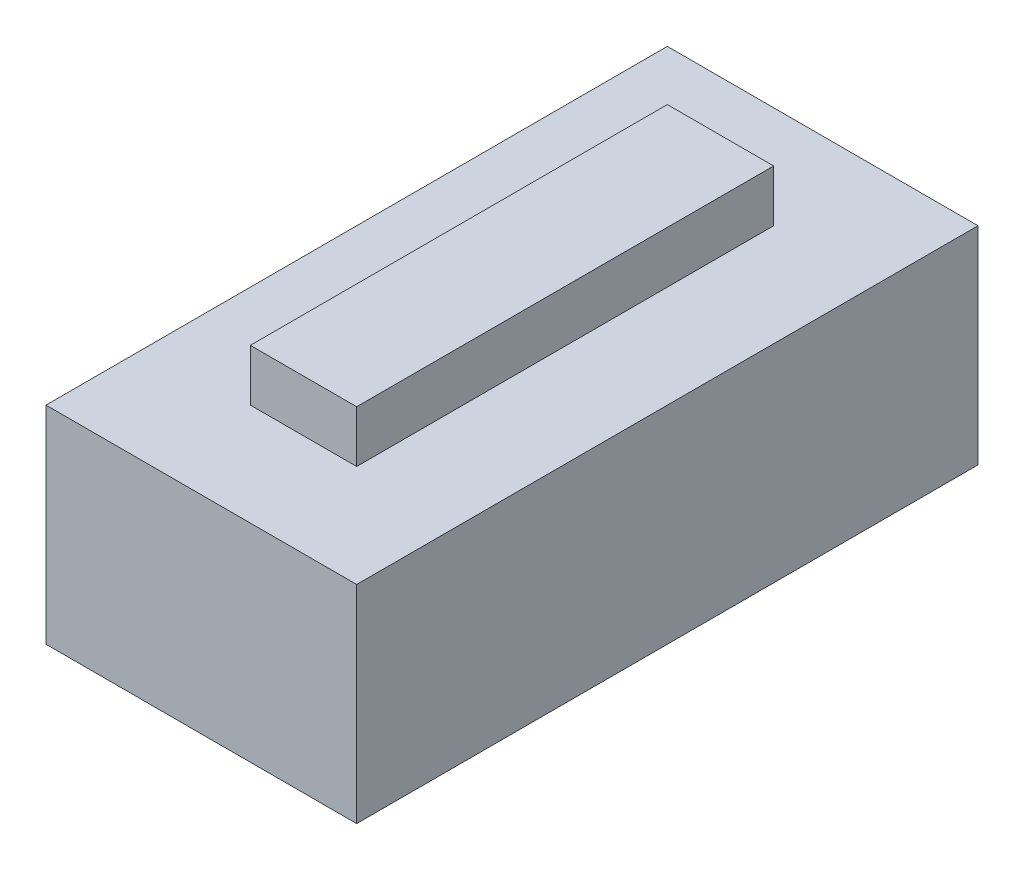
ISO-10303-21;
HEADER;
FILE_DESCRIPTION(('STEP AP214'),'2;1');
FILE_NAME('part.step','',(''),(''),'','','');
FILE_SCHEMA(('AUTOMOTIVE_DESIGN { 1 0 10303 214 1 1 1 1 }'));
ENDSEC;
DATA;
#1=APPLICATION_CONTEXT('core data for automotive mechanical design processes');
#2=APPLICATION_PROTOCOL_DEFINITION('international standard','automotive_design',2000,#1);
#3=PRODUCT_CONTEXT('',#1,'mechanical');
#4=PRODUCT('Part','Part','',(#3));
#5=PRODUCT_RELATED_PRODUCT_CATEGORY('part','',(#4));
#6=PRODUCT_DEFINITION_FORMATION('','',#4);
#7=PRODUCT_DEFINITION_CONTEXT('part definition',#1,'design');
#8=PRODUCT_DEFINITION('design','',#6,#7);
#9=PRODUCT_DEFINITION_SHAPE('','',#8);
#10=(LENGTH_UNIT() NAMED_UNIT(*) SI_UNIT(.MILLI.,.METRE.));
#11=(NAMED_UNIT(*) PLANE_ANGLE_UNIT() SI_UNIT($,.RADIAN.));
#12=(NAMED_UNIT(*) SI_UNIT($,.STERADIAN.) SOLID_ANGLE_UNIT());
#13=UNCERTAINTY_MEASURE_WITH_UNIT(LENGTH_MEASURE(1.E-05),#10,'distance_accuracy_value','');
#14=(GEOMETRIC_REPRESENTATION_CONTEXT(3) GLOBAL_UNCERTAINTY_ASSIGNED_CONTEXT((#13)) GLOBAL_UNIT_ASSIGNED_CONTEXT((#10,
#11,#12)) REPRESENTATION_CONTEXT('',''));
#15=CARTESIAN_POINT('',(0.,0.,0.));
#16=DIRECTION('',(0.,0.,1.));
#17=DIRECTION('',(1.,0.,0.));
#18=AXIS2_PLACEMENT_3D('',#15,#16,#17);
#19=CARTESIAN_POINT('',(-4.43132054060698,5.50000004055861,-39.1298540681601));
#20=DIRECTION('',(0.,0.,-1.));
#21=DIRECTION('',(0.,-1.,0.));
#22=AXIS2_PLACEMENT_3D('',#19,#20,#21);
#23=PLANE('',#22);
#24=DIRECTION('',(1.,0.,0.));
#25=VECTOR('',#24,1.);
#26=CARTESIAN_POINT('',(3.27780229315332,3.50000004055861,-39.1298540681601));
#27=LINE('',#26,#25);
#28=CARTESIAN_POINT('',(-4.43132054060698,3.50000004055861,-39.1298540681601));
#29=VERTEX_POINT('',#28);
#30=CARTESIAN_POINT('',(-1.43132049590349,3.50000004055861,-39.1298540681601));
#31=VERTEX_POINT('',#30);
#32=EDGE_CURVE('E133',#29,#31,#27,.T.);
#33=ORIENTED_EDGE('',*,*,#32,.T.);
#34=DIRECTION('',(0.,-1.,0.));
#35=VECTOR('',#34,1.);
#36=CARTESIAN_POINT('',(-1.43132049590349,5.50000004055861,-39.1298540681601));
#37=LINE('',#36,#35);
#38=CARTESIAN_POINT('',(-1.43132049590349,1.49999995944139,-39.1298540681601));
#39=VERTEX_POINT('',#38);
#40=EDGE_CURVE('E11',#31,#39,#37,.T.);
#41=ORIENTED_EDGE('',*,*,#40,.T.);
#42=DIRECTION('',(1.,0.,0.));
#43=VECTOR('',#42,1.);
#44=CARTESIAN_POINT('',(-2.21566027030349,1.5,-39.1298540681601));
#45=LINE('',#44,#43);
#46=CARTESIAN_POINT('',(-4.43132054060698,1.49999995944139,-39.1298540681601));
#47=VERTEX_POINT('',#46);
#48=EDGE_CURVE('E166',#47,#39,#45,.T.);
#49=ORIENTED_EDGE('',*,*,#48,.F.);
#50=DIRECTION('',(0.,-1.,0.));
#51=VECTOR('',#50,1.);
#52=CARTESIAN_POINT('',(-4.43132054060698,5.50000004055861,-39.1298540681601));
#53=LINE('',#52,#51);
#54=EDGE_CURVE('E27',#29,#47,#53,.T.);
#55=ORIENTED_EDGE('',*,*,#54,.F.);
#56=EDGE_LOOP('',(#33,#41,#49,#55));
#57=FACE_BOUND('',#56,.T.);
#58=ADVANCED_FACE('F16',(#57),#23,.T.);
#59=CARTESIAN_POINT('',(-1.43132049590349,5.50000004055861,-39.1298540681601));
#60=DIRECTION('',(1.,0.,0.));
#61=DIRECTION('',(0.,1.,0.));
#62=AXIS2_PLACEMENT_3D('',#59,#60,#61);
#63=PLANE('',#62);
#64=DIRECTION('',(0.,0.,1.));
#65=VECTOR('',#64,1.);
#66=CARTESIAN_POINT('',(-1.43132049590349,3.50000004055861,-23.2105978149711));
#67=LINE('',#66,#65);
#68=CARTESIAN_POINT('',(-1.43132049590349,3.50000004055861,-33.1298539787531));
#69=VERTEX_POINT('',#68);
#70=EDGE_CURVE('E182',#31,#69,#67,.T.);
#71=ORIENTED_EDGE('',*,*,#70,.T.);
#72=DIRECTION('',(0.,-1.,0.));
#73=VECTOR('',#72,1.);
#74=CARTESIAN_POINT('',(-1.43132049590349,5.50000004055861,-33.1298539787531));
#75=LINE('',#74,#73);
#76=CARTESIAN_POINT('',(-1.43132049590349,1.49999995944139,-33.1298539787531));
#77=VERTEX_POINT('',#76);
#78=EDGE_CURVE('E146',#69,#77,#75,.T.);
#79=ORIENTED_EDGE('',*,*,#78,.T.);
#80=DIRECTION('',(0.,0.,1.));
#81=VECTOR('',#80,1.);
#82=CARTESIAN_POINT('',(-1.43132049590349,1.5,-19.56492703408));
#83=LINE('',#82,#81);
#84=EDGE_CURVE('E164',#39,#77,#83,.T.);
#85=ORIENTED_EDGE('',*,*,#84,.F.);
#86=ORIENTED_EDGE('',*,*,#40,.F.);
#87=EDGE_LOOP('',(#71,#79,#85,#86));
#88=FACE_BOUND('',#87,.T.);
#89=ADVANCED_FACE('F210',(#88),#63,.T.);
#90=CARTESIAN_POINT('',(-4.43132054060698,5.50000004055861,-33.1298539787531));
#91=DIRECTION('',(-1.,0.,0.));
#92=DIRECTION('',(0.,0.,1.));
#93=AXIS2_PLACEMENT_3D('',#90,#91,#92);
#94=PLANE('',#93);
#95=DIRECTION('',(0.,0.,-1.));
#96=VECTOR('',#95,1.);
#97=CARTESIAN_POINT('',(-4.43132054060697,3.50000004055861,-20.2105977702676));
#98=LINE('',#97,#96);
#99=CARTESIAN_POINT('',(-4.43132054060698,3.50000004055861,-33.1298539787531));
#100=VERTEX_POINT('',#99);
#101=EDGE_CURVE('E138',#100,#29,#98,.T.);
#102=ORIENTED_EDGE('',*,*,#101,.T.);
#103=ORIENTED_EDGE('',*,*,#54,.T.);
#104=DIRECTION('',(0.,0.,-1.));
#105=VECTOR('',#104,1.);
#106=CARTESIAN_POINT('',(-4.43132054060698,1.5,-16.5649269893765));
#107=LINE('',#106,#105);
#108=CARTESIAN_POINT('',(-4.43132054060698,1.49999995944139,-33.1298539787531));
#109=VERTEX_POINT('',#108);
#110=EDGE_CURVE('E151',#109,#47,#107,.T.);
#111=ORIENTED_EDGE('',*,*,#110,.F.);
#112=DIRECTION('',(0.,-1.,0.));
#113=VECTOR('',#112,1.);
#114=CARTESIAN_POINT('',(-4.43132054060698,5.50000004055861,-33.1298539787531));
#115=LINE('',#114,#113);
#116=EDGE_CURVE('E143',#100,#109,#115,.T.);
#117=ORIENTED_EDGE('',*,*,#116,.F.);
#118=EDGE_LOOP('',(#102,#103,#111,#117));
#119=FACE_BOUND('',#118,.T.);
#120=ADVANCED_FACE('F212',(#119),#94,.T.);
#121=CARTESIAN_POINT('',(-1.43132049590349,5.50000004055861,-33.1298539787531));
#122=DIRECTION('',(0.,0.,1.));
#123=DIRECTION('',(1.,0.,0.));
#124=AXIS2_PLACEMENT_3D('',#121,#122,#123);
#125=PLANE('',#124);
#126=DIRECTION('',(-1.,0.,0.));
#127=VECTOR('',#126,1.);
#128=CARTESIAN_POINT('',(4.77780231550506,3.50000004055861,-33.1298539787531));
#129=LINE('',#128,#127);
#130=EDGE_CURVE('E142',#69,#100,#129,.T.);
#131=ORIENTED_EDGE('',*,*,#130,.T.);
#132=ORIENTED_EDGE('',*,*,#116,.T.);
#133=DIRECTION('',(-1.,0.,0.));
#134=VECTOR('',#133,1.);
#135=CARTESIAN_POINT('',(-0.715660247951746,1.5,-33.1298539787531));
#136=LINE('',#135,#134);
#137=EDGE_CURVE('E147',#77,#109,#136,.T.);
#138=ORIENTED_EDGE('',*,*,#137,.F.);
#139=ORIENTED_EDGE('',*,*,#78,.F.);
#140=EDGE_LOOP('',(#131,#132,#138,#139));
#141=FACE_BOUND('',#140,.T.);
#142=ADVANCED_FACE('F18',(#141),#125,.T.);
#143=CARTESIAN_POINT('',(10.9869251269136,3.50000004055861,-7.29134156178215));
#144=DIRECTION('',(0.,-1.,0.));
#145=DIRECTION('',(0.,0.,-1.));
#146=AXIS2_PLACEMENT_3D('',#143,#144,#145);
#147=PLANE('',#146);
#148=DIRECTION('',(1.,0.,0.));
#149=VECTOR('',#148,1.);
#150=CARTESIAN_POINT('',(3.77108865187963,3.50000004055861,-38.1432813507074));
#151=LINE('',#150,#149);
#152=CARTESIAN_POINT('',(-3.44474782315435,3.5,-38.1432813507074));
#153=VERTEX_POINT('',#152);
#154=CARTESIAN_POINT('',(-2.41789321335612,3.5,-38.1432813507074));
#155=VERTEX_POINT('',#154);
#156=EDGE_CURVE('E135',#153,#155,#151,.T.);
#157=ORIENTED_EDGE('',*,*,#156,.T.);
#158=DIRECTION('',(0.,0.,1.));
#159=VECTOR('',#158,1.);
#160=CARTESIAN_POINT('',(-2.41789321335612,3.50000004055861,-22.7173114562448));
#161=LINE('',#160,#159);
#162=CARTESIAN_POINT('',(-2.41789321335612,3.5,-34.1164266962057));
#163=VERTEX_POINT('',#162);
#164=EDGE_CURVE('E153',#155,#163,#161,.T.);
#165=ORIENTED_EDGE('',*,*,#164,.T.);
#166=DIRECTION('',(-1.,0.,0.));
#167=VECTOR('',#166,1.);
#168=CARTESIAN_POINT('',(4.28451595677875,3.50000004055861,-34.1164266962057));
#169=LINE('',#168,#167);
#170=CARTESIAN_POINT('',(-3.44474782315435,3.5,-34.1164266962057));
#171=VERTEX_POINT('',#170);
#172=EDGE_CURVE('E113',#163,#171,#169,.T.);
#173=ORIENTED_EDGE('',*,*,#172,.T.);
#174=DIRECTION('',(0.,0.,-1.));
#175=VECTOR('',#174,1.);
#176=CARTESIAN_POINT('',(-3.44474782315435,3.50000004055861,-20.7038841289939));
#177=LINE('',#176,#175);
#178=EDGE_CURVE('E111',#171,#153,#177,.T.);
#179=ORIENTED_EDGE('',*,*,#178,.T.);
#180=EDGE_LOOP('',(#157,#165,#173,#179));
#181=FACE_BOUND('',#180,.T.);
#182=ORIENTED_EDGE('',*,*,#101,.F.);
#183=ORIENTED_EDGE('',*,*,#130,.F.);
#184=ORIENTED_EDGE('',*,*,#70,.F.);
#185=ORIENTED_EDGE('',*,*,#32,.F.);
#186=EDGE_LOOP('',(#182,#183,#184,#185));
#187=FACE_BOUND('',#186,.T.);
#188=ADVANCED_FACE('F194',(#181,#187),#147,.F.);
#189=CARTESIAN_POINT('',(-2.41789321335612,5.50000004055861,-34.1164266962057));
#190=DIRECTION('',(0.,0.,1.));
#191=DIRECTION('',(1.,0.,0.));
#192=AXIS2_PLACEMENT_3D('',#189,#190,#191);
#193=PLANE('',#192);
#194=DIRECTION('',(-1.,0.,0.));
#195=VECTOR('',#194,1.);
#196=CARTESIAN_POINT('',(4.28451595677875,4.00000004055861,-34.1164266962057));
#197=LINE('',#196,#195);
#198=CARTESIAN_POINT('',(-2.41789321335612,4.00000004055861,-34.1164266962057));
#199=VERTEX_POINT('',#198);
#200=CARTESIAN_POINT('',(-3.44474782315435,4.00000004055861,-34.1164266962057));
#201=VERTEX_POINT('',#200);
#202=EDGE_CURVE('E115',#199,#201,#197,.T.);
#203=ORIENTED_EDGE('',*,*,#202,.T.);
#204=DIRECTION('',(0.,-1.,0.));
#205=VECTOR('',#204,1.);
#206=CARTESIAN_POINT('',(-3.44474782315435,5.50000004055861,-34.1164266962057));
#207=LINE('',#206,#205);
#208=EDGE_CURVE('E105',#201,#171,#207,.T.);
#209=ORIENTED_EDGE('',*,*,#208,.T.);
#210=ORIENTED_EDGE('',*,*,#172,.F.);
#211=DIRECTION('',(0.,-1.,0.));
#212=VECTOR('',#211,1.);
#213=CARTESIAN_POINT('',(-2.41789321335612,5.50000004055861,-34.1164266962057));
#214=LINE('',#213,#212);
#215=EDGE_CURVE('E62',#199,#163,#214,.T.);
#216=ORIENTED_EDGE('',*,*,#215,.F.);
#217=EDGE_LOOP('',(#203,#209,#210,#216));
#218=FACE_BOUND('',#217,.T.);
#219=ADVANCED_FACE('F116',(#218),#193,.T.);
#220=CARTESIAN_POINT('',(-3.44474782315435,5.50000004055861,-34.1164266962057));
#221=DIRECTION('',(-1.,0.,0.));
#222=DIRECTION('',(0.,0.,1.));
#223=AXIS2_PLACEMENT_3D('',#220,#221,#222);
#224=PLANE('',#223);
#225=DIRECTION('',(0.,0.,-1.));
#226=VECTOR('',#225,1.);
#227=CARTESIAN_POINT('',(-3.44474782315435,4.00000004055861,-20.7038841289939));
#228=LINE('',#227,#226);
#229=CARTESIAN_POINT('',(-3.44474782315435,4.00000004055861,-38.1432813507074));
#230=VERTEX_POINT('',#229);
#231=EDGE_CURVE('E109',#201,#230,#228,.T.);
#232=ORIENTED_EDGE('',*,*,#231,.T.);
#233=DIRECTION('',(0.,-1.,0.));
#234=VECTOR('',#233,1.);
#235=CARTESIAN_POINT('',(-3.44474782315435,5.50000004055861,-38.1432813507074));
#236=LINE('',#235,#234);
#237=EDGE_CURVE('E20',#230,#153,#236,.T.);
#238=ORIENTED_EDGE('',*,*,#237,.T.);
#239=ORIENTED_EDGE('',*,*,#178,.F.);
#240=ORIENTED_EDGE('',*,*,#208,.F.);
#241=EDGE_LOOP('',(#232,#238,#239,#240));
#242=FACE_BOUND('',#241,.T.);
#243=ADVANCED_FACE('F106',(#242),#224,.T.);
#244=CARTESIAN_POINT('',(-2.41789321335612,5.50000004055861,-38.1432813507074));
#245=DIRECTION('',(1.,0.,0.));
#246=DIRECTION('',(0.,1.,0.));
#247=AXIS2_PLACEMENT_3D('',#244,#245,#246);
#248=PLANE('',#247);
#249=DIRECTION('',(0.,0.,1.));
#250=VECTOR('',#249,1.);
#251=CARTESIAN_POINT('',(-2.41789321335612,4.00000004055861,-22.7173114562448));
#252=LINE('',#251,#250);
#253=CARTESIAN_POINT('',(-2.41789321335612,4.00000004055861,-38.1432813507074));
#254=VERTEX_POINT('',#253);
#255=EDGE_CURVE('E129',#254,#199,#252,.T.);
#256=ORIENTED_EDGE('',*,*,#255,.T.);
#257=ORIENTED_EDGE('',*,*,#215,.T.);
#258=ORIENTED_EDGE('',*,*,#164,.F.);
#259=DIRECTION('',(0.,-1.,0.));
#260=VECTOR('',#259,1.);
#261=CARTESIAN_POINT('',(-2.41789321335612,5.50000004055861,-38.1432813507074));
#262=LINE('',#261,#260);
#263=EDGE_CURVE('E78',#254,#155,#262,.T.);
#264=ORIENTED_EDGE('',*,*,#263,.F.);
#265=EDGE_LOOP('',(#256,#257,#258,#264));
#266=FACE_BOUND('',#265,.T.);
#267=ADVANCED_FACE('F225',(#266),#248,.T.);
#268=CARTESIAN_POINT('',(-3.44474782315435,5.50000004055861,-38.1432813507074));
#269=DIRECTION('',(0.,0.,-1.));
#270=DIRECTION('',(0.,-1.,0.));
#271=AXIS2_PLACEMENT_3D('',#268,#269,#270);
#272=PLANE('',#271);
#273=DIRECTION('',(1.,0.,0.));
#274=VECTOR('',#273,1.);
#275=CARTESIAN_POINT('',(3.77108865187963,4.00000004055861,-38.1432813507074));
#276=LINE('',#275,#274);
#277=EDGE_CURVE('E122',#230,#254,#276,.T.);
#278=ORIENTED_EDGE('',*,*,#277,.T.);
#279=ORIENTED_EDGE('',*,*,#263,.T.);
#280=ORIENTED_EDGE('',*,*,#156,.F.);
#281=ORIENTED_EDGE('',*,*,#237,.F.);
#282=EDGE_LOOP('',(#278,#279,#280,#281));
#283=FACE_BOUND('',#282,.T.);
#284=ADVANCED_FACE('F232',(#283),#272,.T.);
#285=CARTESIAN_POINT('',(10.9869251269136,4.00000004055861,-7.29134156178215));
#286=DIRECTION('',(0.,-1.,0.));
#287=DIRECTION('',(0.,0.,-1.));
#288=AXIS2_PLACEMENT_3D('',#285,#286,#287);
#289=PLANE('',#288);
#290=ORIENTED_EDGE('',*,*,#255,.F.);
#291=ORIENTED_EDGE('',*,*,#277,.F.);
#292=ORIENTED_EDGE('',*,*,#231,.F.);
#293=ORIENTED_EDGE('',*,*,#202,.F.);
#294=EDGE_LOOP('',(#290,#291,#292,#293));
#295=FACE_BOUND('',#294,.T.);
#296=ADVANCED_FACE('F121',(#295),#289,.F.);
#297=CARTESIAN_POINT('',(-2.655,1.5,-0.520482398309197));
#298=DIRECTION('',(0.,1.,0.));
#299=DIRECTION('',(1.,0.,0.));
#300=AXIS2_PLACEMENT_3D('',#297,#298,#299);
#301=PLANE('',#300);
#302=ORIENTED_EDGE('',*,*,#137,.T.);
#303=ORIENTED_EDGE('',*,*,#110,.T.);
#304=ORIENTED_EDGE('',*,*,#48,.T.);
#305=ORIENTED_EDGE('',*,*,#84,.T.);
#306=EDGE_LOOP('',(#302,#303,#304,#305));
#307=FACE_BOUND('',#306,.T.);
#308=ADVANCED_FACE('F207',(#307),#301,.F.);
#309=CLOSED_SHELL('',(#58,#89,#120,#142,#188,#219,#243,#267,#284,#296,#308));
#310=MANIFOLD_SOLID_BREP('B1',#309);
#311=ADVANCED_BREP_SHAPE_REPRESENTATION('',(#18,#310),#14);
#312=SHAPE_DEFINITION_REPRESENTATION(#9,#311);
ENDSEC;
END-ISO-10303-21;
